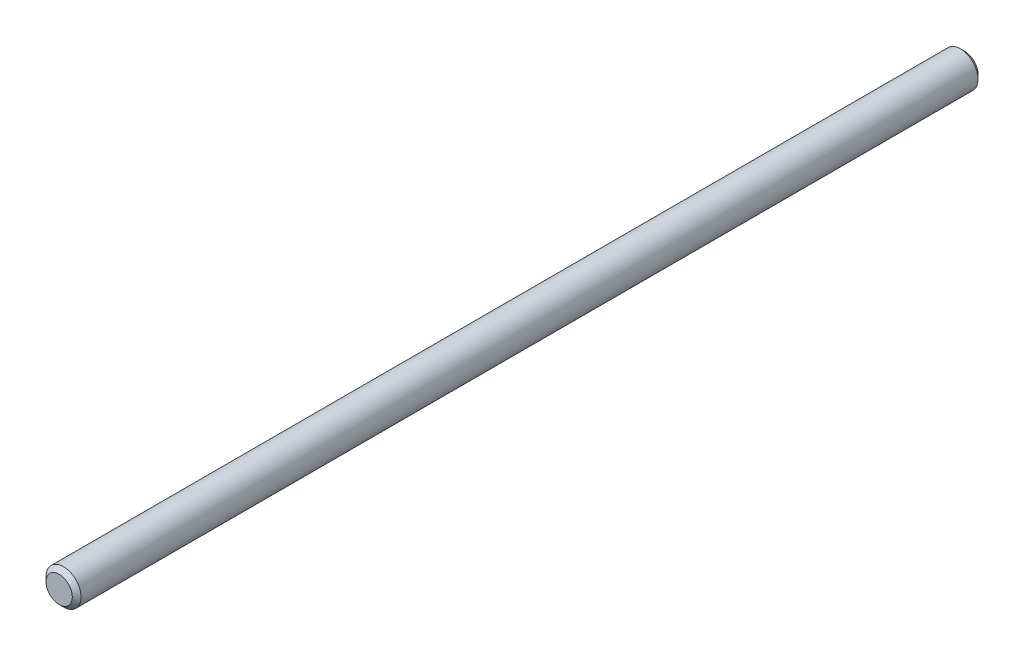
ISO-10303-21;
HEADER;
FILE_DESCRIPTION(('STEP AP214'),'2;1');
FILE_NAME('part.step','',(''),(''),'','','');
FILE_SCHEMA(('AUTOMOTIVE_DESIGN { 1 0 10303 214 1 1 1 1 }'));
ENDSEC;
DATA;
#1=APPLICATION_CONTEXT('core data for automotive mechanical design processes');
#2=APPLICATION_PROTOCOL_DEFINITION('international standard','automotive_design',2000,#1);
#3=PRODUCT_CONTEXT('',#1,'mechanical');
#4=PRODUCT('Part','Part','',(#3));
#5=PRODUCT_RELATED_PRODUCT_CATEGORY('part','',(#4));
#6=PRODUCT_DEFINITION_FORMATION('','',#4);
#7=PRODUCT_DEFINITION_CONTEXT('part definition',#1,'design');
#8=PRODUCT_DEFINITION('design','',#6,#7);
#9=PRODUCT_DEFINITION_SHAPE('','',#8);
#10=(LENGTH_UNIT() NAMED_UNIT(*) SI_UNIT(.MILLI.,.METRE.));
#11=(NAMED_UNIT(*) PLANE_ANGLE_UNIT() SI_UNIT($,.RADIAN.));
#12=(NAMED_UNIT(*) SI_UNIT($,.STERADIAN.) SOLID_ANGLE_UNIT());
#13=UNCERTAINTY_MEASURE_WITH_UNIT(LENGTH_MEASURE(1.E-05),#10,'distance_accuracy_value','');
#14=(GEOMETRIC_REPRESENTATION_CONTEXT(3) GLOBAL_UNCERTAINTY_ASSIGNED_CONTEXT((#13)) GLOBAL_UNIT_ASSIGNED_CONTEXT((#10,
#11,#12)) REPRESENTATION_CONTEXT('',''));
#15=CARTESIAN_POINT('',(0.,0.,0.));
#16=DIRECTION('',(0.,0.,1.));
#17=DIRECTION('',(1.,0.,0.));
#18=AXIS2_PLACEMENT_3D('',#15,#16,#17);
#19=CARTESIAN_POINT('',(0.,0.,310.));
#20=DIRECTION('',(0.,0.,-1.));
#21=DIRECTION('',(-1.,0.,0.));
#22=AXIS2_PLACEMENT_3D('',#19,#20,#21);
#23=CYLINDRICAL_SURFACE('',#22,6.);
#24=CARTESIAN_POINT('',(0.,0.,308.5));
#25=DIRECTION('',(0.,0.,1.));
#26=DIRECTION('',(1.,0.,0.));
#27=AXIS2_PLACEMENT_3D('',#24,#25,#26);
#28=CIRCLE('',#27,6.);
#29=CARTESIAN_POINT('',(6.,0.,308.5));
#30=VERTEX_POINT('',#29);
#31=EDGE_CURVE('E46',#30,#30,#28,.F.);
#32=ORIENTED_EDGE('',*,*,#31,.T.);
#33=EDGE_LOOP('',(#32));
#34=FACE_BOUND('',#33,.T.);
#35=CARTESIAN_POINT('',(0.,0.,1.5));
#36=DIRECTION('',(0.,0.,1.));
#37=DIRECTION('',(1.,0.,0.));
#38=AXIS2_PLACEMENT_3D('',#35,#36,#37);
#39=CIRCLE('',#38,6.);
#40=CARTESIAN_POINT('',(6.,0.,1.5));
#41=VERTEX_POINT('',#40);
#42=EDGE_CURVE('E50',#41,#41,#39,.T.);
#43=ORIENTED_EDGE('',*,*,#42,.T.);
#44=EDGE_LOOP('',(#43));
#45=FACE_BOUND('',#44,.T.);
#46=ADVANCED_FACE('F38',(#34,#45),#23,.T.);
#47=CARTESIAN_POINT('',(0.,0.,310.));
#48=DIRECTION('',(0.,0.,1.));
#49=DIRECTION('',(1.,0.,0.));
#50=AXIS2_PLACEMENT_3D('',#47,#48,#49);
#51=PLANE('',#50);
#52=CARTESIAN_POINT('',(0.,0.,310.));
#53=DIRECTION('',(0.,0.,1.));
#54=DIRECTION('',(1.,0.,0.));
#55=AXIS2_PLACEMENT_3D('',#52,#53,#54);
#56=CIRCLE('',#55,4.50000000000003);
#57=CARTESIAN_POINT('',(4.50000000000003,0.,310.));
#58=VERTEX_POINT('',#57);
#59=EDGE_CURVE('E54',#58,#58,#56,.T.);
#60=ORIENTED_EDGE('',*,*,#59,.T.);
#61=EDGE_LOOP('',(#60));
#62=FACE_BOUND('',#61,.T.);
#63=ADVANCED_FACE('F60',(#62),#51,.T.);
#64=CARTESIAN_POINT('',(0.,0.,0.));
#65=DIRECTION('',(0.,0.,1.));
#66=DIRECTION('',(1.,0.,0.));
#67=AXIS2_PLACEMENT_3D('',#64,#65,#66);
#68=PLANE('',#67);
#69=CARTESIAN_POINT('',(0.,0.,0.));
#70=DIRECTION('',(0.,0.,1.));
#71=DIRECTION('',(1.,0.,0.));
#72=AXIS2_PLACEMENT_3D('',#69,#70,#71);
#73=CIRCLE('',#72,4.50000000000003);
#74=CARTESIAN_POINT('',(4.50000000000003,0.,0.));
#75=VERTEX_POINT('',#74);
#76=EDGE_CURVE('E10',#75,#75,#73,.F.);
#77=ORIENTED_EDGE('',*,*,#76,.T.);
#78=EDGE_LOOP('',(#77));
#79=FACE_BOUND('',#78,.T.);
#80=ADVANCED_FACE('F64',(#79),#68,.F.);
#81=CARTESIAN_POINT('',(0.,0.,310.));
#82=DIRECTION('',(0.,0.,-1.));
#83=DIRECTION('',(-1.,0.,0.));
#84=AXIS2_PLACEMENT_3D('',#81,#82,#83);
#85=CONICAL_SURFACE('',#84,4.50000000000003,0.785398163397456);
#86=ORIENTED_EDGE('',*,*,#31,.F.);
#87=EDGE_LOOP('',(#86));
#88=FACE_BOUND('',#87,.T.);
#89=ORIENTED_EDGE('',*,*,#59,.F.);
#90=EDGE_LOOP('',(#89));
#91=FACE_BOUND('',#90,.T.);
#92=ADVANCED_FACE('F62',(#88,#91),#85,.T.);
#93=CARTESIAN_POINT('',(0.,0.,1.5));
#94=DIRECTION('',(0.,0.,1.));
#95=DIRECTION('',(1.,0.,0.));
#96=AXIS2_PLACEMENT_3D('',#93,#94,#95);
#97=CONICAL_SURFACE('',#96,6.,0.785398163397437);
#98=ORIENTED_EDGE('',*,*,#76,.F.);
#99=EDGE_LOOP('',(#98));
#100=FACE_BOUND('',#99,.T.);
#101=ORIENTED_EDGE('',*,*,#42,.F.);
#102=EDGE_LOOP('',(#101));
#103=FACE_BOUND('',#102,.T.);
#104=ADVANCED_FACE('F41',(#100,#103),#97,.T.);
#105=CLOSED_SHELL('',(#46,#63,#80,#92,#104));
#106=MANIFOLD_SOLID_BREP('B2',#105);
#107=ADVANCED_BREP_SHAPE_REPRESENTATION('',(#18,#106),#14);
#108=SHAPE_DEFINITION_REPRESENTATION(#9,#107);
ENDSEC;
END-ISO-10303-21;
